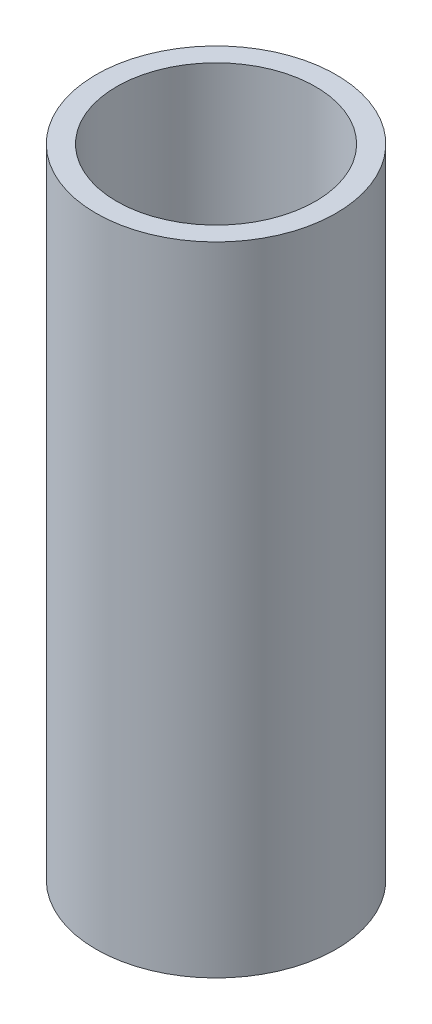
ISO-10303-21;
HEADER;
FILE_DESCRIPTION(('STEP AP214'),'2;1');
FILE_NAME('part.step','',(''),(''),'','','');
FILE_SCHEMA(('AUTOMOTIVE_DESIGN { 1 0 10303 214 1 1 1 1 }'));
ENDSEC;
DATA;
#1=APPLICATION_CONTEXT('core data for automotive mechanical design processes');
#2=APPLICATION_PROTOCOL_DEFINITION('international standard','automotive_design',2000,#1);
#3=PRODUCT_CONTEXT('',#1,'mechanical');
#4=PRODUCT('Part','Part','',(#3));
#5=PRODUCT_RELATED_PRODUCT_CATEGORY('part','',(#4));
#6=PRODUCT_DEFINITION_FORMATION('','',#4);
#7=PRODUCT_DEFINITION_CONTEXT('part definition',#1,'design');
#8=PRODUCT_DEFINITION('design','',#6,#7);
#9=PRODUCT_DEFINITION_SHAPE('','',#8);
#10=(LENGTH_UNIT() NAMED_UNIT(*) SI_UNIT(.MILLI.,.METRE.));
#11=(NAMED_UNIT(*) PLANE_ANGLE_UNIT() SI_UNIT($,.RADIAN.));
#12=(NAMED_UNIT(*) SI_UNIT($,.STERADIAN.) SOLID_ANGLE_UNIT());
#13=UNCERTAINTY_MEASURE_WITH_UNIT(LENGTH_MEASURE(1.E-05),#10,'distance_accuracy_value','');
#14=(GEOMETRIC_REPRESENTATION_CONTEXT(3) GLOBAL_UNCERTAINTY_ASSIGNED_CONTEXT((#13)) GLOBAL_UNIT_ASSIGNED_CONTEXT((#10,
#11,#12)) REPRESENTATION_CONTEXT('',''));
#15=CARTESIAN_POINT('',(0.,0.,0.));
#16=DIRECTION('',(0.,0.,1.));
#17=DIRECTION('',(1.,0.,0.));
#18=AXIS2_PLACEMENT_3D('',#15,#16,#17);
#19=CARTESIAN_POINT('',(0.,278.736227608205,0.));
#20=DIRECTION('',(0.,-1.,0.));
#21=DIRECTION('',(0.,0.,-1.));
#22=AXIS2_PLACEMENT_3D('',#19,#20,#21);
#23=CYLINDRICAL_SURFACE('',#22,52.5);
#24=CARTESIAN_POINT('',(0.,278.736227608205,0.));
#25=DIRECTION('',(0.,1.,0.));
#26=DIRECTION('',(0.,0.,1.));
#27=AXIS2_PLACEMENT_3D('',#24,#25,#26);
#28=CIRCLE('',#27,52.5);
#29=CARTESIAN_POINT('',(0.,278.736227608205,52.5));
#30=VERTEX_POINT('',#29);
#31=EDGE_CURVE('E10',#30,#30,#28,.T.);
#32=ORIENTED_EDGE('',*,*,#31,.F.);
#33=EDGE_LOOP('',(#32));
#34=FACE_BOUND('',#33,.T.);
#35=CARTESIAN_POINT('',(0.,0.,0.));
#36=DIRECTION('',(0.,1.,0.));
#37=DIRECTION('',(0.,0.,1.));
#38=AXIS2_PLACEMENT_3D('',#35,#36,#37);
#39=CIRCLE('',#38,52.5);
#40=CARTESIAN_POINT('',(0.,0.,52.5));
#41=VERTEX_POINT('',#40);
#42=EDGE_CURVE('E37',#41,#41,#39,.T.);
#43=ORIENTED_EDGE('',*,*,#42,.T.);
#44=EDGE_LOOP('',(#43));
#45=FACE_BOUND('',#44,.T.);
#46=ADVANCED_FACE('F40',(#34,#45),#23,.T.);
#47=CARTESIAN_POINT('',(0.,278.736227608205,0.));
#48=DIRECTION('',(0.,1.,0.));
#49=DIRECTION('',(0.,0.,1.));
#50=AXIS2_PLACEMENT_3D('',#47,#48,#49);
#51=PLANE('',#50);
#52=CARTESIAN_POINT('',(0.,278.736227608205,0.));
#53=DIRECTION('',(0.,1.,0.));
#54=DIRECTION('',(0.,0.,1.));
#55=AXIS2_PLACEMENT_3D('',#52,#53,#54);
#56=CIRCLE('',#55,43.4719906413982);
#57=CARTESIAN_POINT('',(0.,278.736227608205,43.4719906413982));
#58=VERTEX_POINT('',#57);
#59=EDGE_CURVE('E50',#58,#58,#56,.T.);
#60=ORIENTED_EDGE('',*,*,#59,.F.);
#61=EDGE_LOOP('',(#60));
#62=FACE_BOUND('',#61,.T.);
#63=ORIENTED_EDGE('',*,*,#31,.T.);
#64=EDGE_LOOP('',(#63));
#65=FACE_BOUND('',#64,.T.);
#66=ADVANCED_FACE('F59',(#62,#65),#51,.T.);
#67=CARTESIAN_POINT('',(0.,0.,0.));
#68=DIRECTION('',(0.,1.,0.));
#69=DIRECTION('',(0.,0.,1.));
#70=AXIS2_PLACEMENT_3D('',#67,#68,#69);
#71=PLANE('',#70);
#72=CARTESIAN_POINT('',(0.,0.,0.));
#73=DIRECTION('',(0.,1.,0.));
#74=DIRECTION('',(0.,0.,1.));
#75=AXIS2_PLACEMENT_3D('',#72,#73,#74);
#76=CIRCLE('',#75,43.4719906413982);
#77=CARTESIAN_POINT('',(0.,0.,43.4719906413982));
#78=VERTEX_POINT('',#77);
#79=EDGE_CURVE('E47',#78,#78,#76,.T.);
#80=ORIENTED_EDGE('',*,*,#79,.T.);
#81=EDGE_LOOP('',(#80));
#82=FACE_BOUND('',#81,.T.);
#83=ORIENTED_EDGE('',*,*,#42,.F.);
#84=EDGE_LOOP('',(#83));
#85=FACE_BOUND('',#84,.T.);
#86=ADVANCED_FACE('F58',(#82,#85),#71,.F.);
#87=CARTESIAN_POINT('',(0.,278.736227608205,0.));
#88=DIRECTION('',(0.,-1.,0.));
#89=DIRECTION('',(0.,0.,-1.));
#90=AXIS2_PLACEMENT_3D('',#87,#88,#89);
#91=CYLINDRICAL_SURFACE('',#90,43.4719906413982);
#92=ORIENTED_EDGE('',*,*,#59,.T.);
#93=EDGE_LOOP('',(#92));
#94=FACE_BOUND('',#93,.T.);
#95=ORIENTED_EDGE('',*,*,#79,.F.);
#96=EDGE_LOOP('',(#95));
#97=FACE_BOUND('',#96,.T.);
#98=ADVANCED_FACE('F54',(#94,#97),#91,.F.);
#99=CLOSED_SHELL('',(#46,#66,#86,#98));
#100=MANIFOLD_SOLID_BREP('B2',#99);
#101=ADVANCED_BREP_SHAPE_REPRESENTATION('',(#18,#100),#14);
#102=SHAPE_DEFINITION_REPRESENTATION(#9,#101);
ENDSEC;
END-ISO-10303-21;
